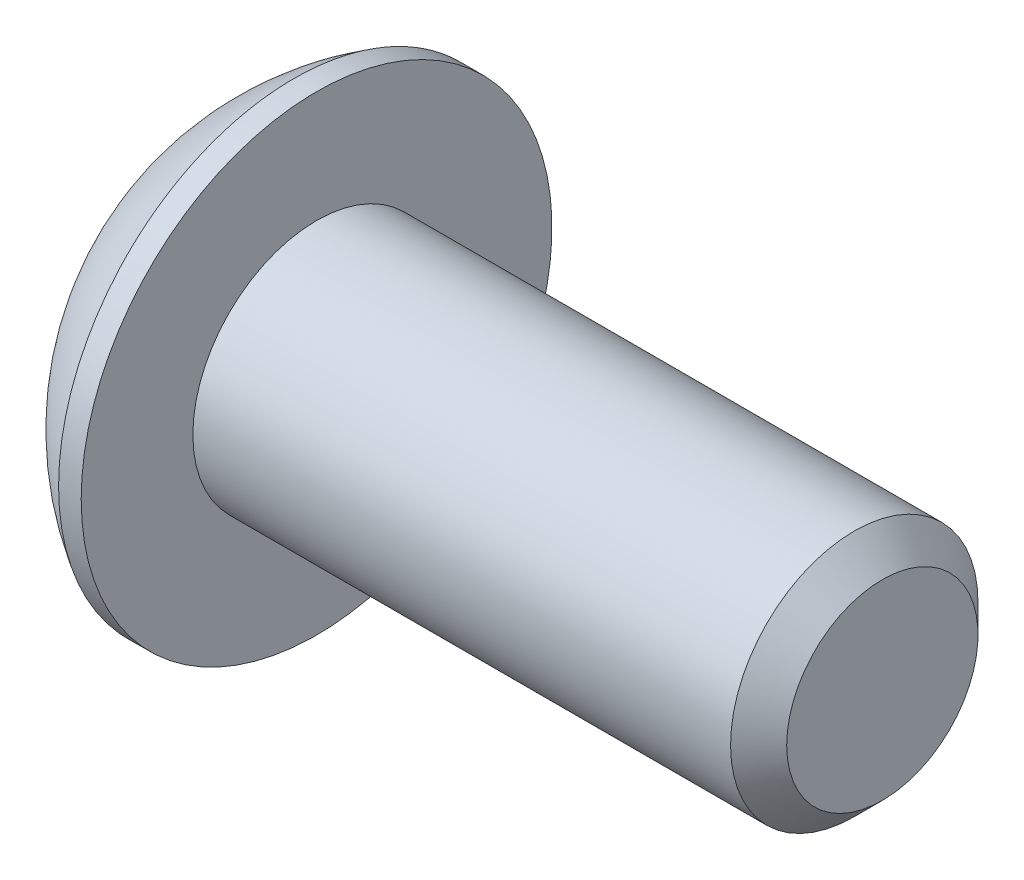
ISO-10303-21;
HEADER;
FILE_DESCRIPTION(('STEP AP214'),'2;1');
FILE_NAME('part.step','',(''),(''),'','','');
FILE_SCHEMA(('AUTOMOTIVE_DESIGN { 1 0 10303 214 1 1 1 1 }'));
ENDSEC;
DATA;
#1=APPLICATION_CONTEXT('core data for automotive mechanical design processes');
#2=APPLICATION_PROTOCOL_DEFINITION('international standard','automotive_design',2000,#1);
#3=PRODUCT_CONTEXT('',#1,'mechanical');
#4=PRODUCT('Part','Part','',(#3));
#5=PRODUCT_RELATED_PRODUCT_CATEGORY('part','',(#4));
#6=PRODUCT_DEFINITION_FORMATION('','',#4);
#7=PRODUCT_DEFINITION_CONTEXT('part definition',#1,'design');
#8=PRODUCT_DEFINITION('design','',#6,#7);
#9=PRODUCT_DEFINITION_SHAPE('','',#8);
#10=(LENGTH_UNIT() NAMED_UNIT(*) SI_UNIT(.MILLI.,.METRE.));
#11=(NAMED_UNIT(*) PLANE_ANGLE_UNIT() SI_UNIT($,.RADIAN.));
#12=(NAMED_UNIT(*) SI_UNIT($,.STERADIAN.) SOLID_ANGLE_UNIT());
#13=UNCERTAINTY_MEASURE_WITH_UNIT(LENGTH_MEASURE(1.E-05),#10,'distance_accuracy_value','');
#14=(GEOMETRIC_REPRESENTATION_CONTEXT(3) GLOBAL_UNCERTAINTY_ASSIGNED_CONTEXT((#13)) GLOBAL_UNIT_ASSIGNED_CONTEXT((#10,
#11,#12)) REPRESENTATION_CONTEXT('',''));
#15=CARTESIAN_POINT('',(0.,0.,0.));
#16=DIRECTION('',(0.,0.,1.));
#17=DIRECTION('',(1.,0.,0.));
#18=AXIS2_PLACEMENT_3D('',#15,#16,#17);
#19=CARTESIAN_POINT('',(1.32080000000034,0.,0.));
#20=DIRECTION('',(-1.,0.,0.));
#21=DIRECTION('',(0.,0.,1.));
#22=AXIS2_PLACEMENT_3D('',#19,#20,#21);
#23=CONICAL_SURFACE('',#22,1.1937999999998,1.04719755119608);
#24=CARTESIAN_POINT('',(2.01004075135902,0.,4.44089209850063E-13));
#25=VERTEX_POINT('',#24);
#26=VERTEX_LOOP('',#25);
#27=FACE_BOUND('',#26,.T.);
#28=CARTESIAN_POINT('',(1.32080000000009,0.,0.));
#29=DIRECTION('',(-1.,0.,0.));
#30=DIRECTION('',(0.,0.,1.));
#31=AXIS2_PLACEMENT_3D('',#28,#29,#30);
#32=CIRCLE('',#31,1.19380000000024);
#33=CARTESIAN_POINT('',(1.32080000000004,-1.03386112703797,0.59690000000006));
#34=VERTEX_POINT('',#33);
#35=CARTESIAN_POINT('',(1.32080000000004,0.,1.19380000000012));
#36=VERTEX_POINT('',#35);
#37=EDGE_CURVE('E19',#34,#36,#32,.T.);
#38=ORIENTED_EDGE('',*,*,#37,.T.);
#39=CARTESIAN_POINT('',(1.32080000000009,0.,0.));
#40=DIRECTION('',(-1.,0.,0.));
#41=DIRECTION('',(0.,0.,1.));
#42=AXIS2_PLACEMENT_3D('',#39,#40,#41);
#43=CIRCLE('',#42,1.19380000000024);
#44=CARTESIAN_POINT('',(1.32080000000004,1.03386112703797,0.596900000000061));
#45=VERTEX_POINT('',#44);
#46=EDGE_CURVE('E148',#36,#45,#43,.T.);
#47=ORIENTED_EDGE('',*,*,#46,.T.);
#48=CARTESIAN_POINT('',(1.32080000000009,0.,0.));
#49=DIRECTION('',(-1.,0.,0.));
#50=DIRECTION('',(0.,0.,1.));
#51=AXIS2_PLACEMENT_3D('',#48,#49,#50);
#52=CIRCLE('',#51,1.19380000000024);
#53=CARTESIAN_POINT('',(1.32080000000004,1.03386112703797,-0.596900000000061));
#54=VERTEX_POINT('',#53);
#55=EDGE_CURVE('E318',#45,#54,#52,.T.);
#56=ORIENTED_EDGE('',*,*,#55,.T.);
#57=CARTESIAN_POINT('',(1.32080000000009,0.,0.));
#58=DIRECTION('',(-1.,0.,0.));
#59=DIRECTION('',(0.,0.,1.));
#60=AXIS2_PLACEMENT_3D('',#57,#58,#59);
#61=CIRCLE('',#60,1.19380000000024);
#62=CARTESIAN_POINT('',(1.32080000000004,1.49457637585666E-12,-1.19380000000012));
#63=VERTEX_POINT('',#62);
#64=EDGE_CURVE('E319',#54,#63,#61,.T.);
#65=ORIENTED_EDGE('',*,*,#64,.T.);
#66=CARTESIAN_POINT('',(1.32080000000009,0.,0.));
#67=DIRECTION('',(-1.,0.,0.));
#68=DIRECTION('',(0.,0.,1.));
#69=AXIS2_PLACEMENT_3D('',#66,#67,#68);
#70=CIRCLE('',#69,1.19380000000024);
#71=CARTESIAN_POINT('',(1.32080000000004,-1.03386112703797,-0.59690000000006));
#72=VERTEX_POINT('',#71);
#73=EDGE_CURVE('E92',#63,#72,#70,.T.);
#74=ORIENTED_EDGE('',*,*,#73,.T.);
#75=CARTESIAN_POINT('',(1.32080000000009,0.,0.));
#76=DIRECTION('',(-1.,0.,0.));
#77=DIRECTION('',(0.,0.,1.));
#78=AXIS2_PLACEMENT_3D('',#75,#76,#77);
#79=CIRCLE('',#78,1.19380000000024);
#80=EDGE_CURVE('E88',#72,#34,#79,.T.);
#81=ORIENTED_EDGE('',*,*,#80,.T.);
#82=EDGE_LOOP('',(#38,#47,#56,#65,#74,#81));
#83=FACE_BOUND('',#82,.T.);
#84=ADVANCED_FACE('F16',(#27,#83),#23,.F.);
#85=CARTESIAN_POINT('',(1.3208,-2.06772225407572,-1.1938));
#86=DIRECTION('',(1.,0.,0.));
#87=DIRECTION('',(0.,0.,-1.));
#88=AXIS2_PLACEMENT_3D('',#85,#86,#87);
#89=PLANE('',#88);
#90=DIRECTION('',(0.,0.5,0.866025403784439));
#91=VECTOR('',#90,1.);
#92=CARTESIAN_POINT('',(1.3208,-1.37848150271715,0.));
#93=LINE('',#92,#91);
#94=CARTESIAN_POINT('',(1.3208,-0.689240751358574,1.1938));
#95=VERTEX_POINT('',#94);
#96=EDGE_CURVE('E100',#95,#34,#93,.F.);
#97=ORIENTED_EDGE('',*,*,#96,.F.);
#98=DIRECTION('',(0.,1.,0.));
#99=VECTOR('',#98,1.);
#100=CARTESIAN_POINT('',(1.3208,-0.689240751358574,1.1938));
#101=LINE('',#100,#99);
#102=EDGE_CURVE('E102',#36,#95,#101,.F.);
#103=ORIENTED_EDGE('',*,*,#102,.F.);
#104=ORIENTED_EDGE('',*,*,#37,.F.);
#105=EDGE_LOOP('',(#97,#103,#104));
#106=FACE_BOUND('',#105,.T.);
#107=ADVANCED_FACE('F98',(#106),#89,.F.);
#108=CARTESIAN_POINT('',(1.3208,-2.06772225407572,-1.1938));
#109=DIRECTION('',(1.,0.,0.));
#110=DIRECTION('',(0.,0.,-1.));
#111=AXIS2_PLACEMENT_3D('',#108,#109,#110);
#112=PLANE('',#111);
#113=DIRECTION('',(0.,-0.5,0.866025403784439));
#114=VECTOR('',#113,1.);
#115=CARTESIAN_POINT('',(1.3208,-0.689240751358574,-1.1938));
#116=LINE('',#115,#114);
#117=CARTESIAN_POINT('',(1.3208,-1.37848150271715,0.));
#118=VERTEX_POINT('',#117);
#119=EDGE_CURVE('E108',#118,#72,#116,.F.);
#120=ORIENTED_EDGE('',*,*,#119,.F.);
#121=DIRECTION('',(0.,0.5,0.866025403784439));
#122=VECTOR('',#121,1.);
#123=CARTESIAN_POINT('',(1.3208,-1.37848150271715,0.));
#124=LINE('',#123,#122);
#125=EDGE_CURVE('E105',#34,#118,#124,.F.);
#126=ORIENTED_EDGE('',*,*,#125,.F.);
#127=ORIENTED_EDGE('',*,*,#80,.F.);
#128=EDGE_LOOP('',(#120,#126,#127));
#129=FACE_BOUND('',#128,.T.);
#130=ADVANCED_FACE('F106',(#129),#112,.F.);
#131=CARTESIAN_POINT('',(1.3208,-2.06772225407572,-1.1938));
#132=DIRECTION('',(1.,0.,0.));
#133=DIRECTION('',(0.,0.,-1.));
#134=AXIS2_PLACEMENT_3D('',#131,#132,#133);
#135=PLANE('',#134);
#136=DIRECTION('',(0.,1.,0.));
#137=VECTOR('',#136,1.);
#138=CARTESIAN_POINT('',(1.3208,0.689240751358577,-1.1938));
#139=LINE('',#138,#137);
#140=CARTESIAN_POINT('',(1.3208,-0.689240751358574,-1.1938));
#141=VERTEX_POINT('',#140);
#142=EDGE_CURVE('E288',#141,#63,#139,.T.);
#143=ORIENTED_EDGE('',*,*,#142,.F.);
#144=DIRECTION('',(0.,-0.5,0.866025403784439));
#145=VECTOR('',#144,1.);
#146=CARTESIAN_POINT('',(1.3208,-0.689240751358574,-1.1938));
#147=LINE('',#146,#145);
#148=EDGE_CURVE('E300',#72,#141,#147,.F.);
#149=ORIENTED_EDGE('',*,*,#148,.F.);
#150=ORIENTED_EDGE('',*,*,#73,.F.);
#151=EDGE_LOOP('',(#143,#149,#150));
#152=FACE_BOUND('',#151,.T.);
#153=ADVANCED_FACE('F191',(#152),#135,.F.);
#154=CARTESIAN_POINT('',(1.3208,-2.06772225407572,-1.1938));
#155=DIRECTION('',(1.,0.,0.));
#156=DIRECTION('',(0.,0.,-1.));
#157=AXIS2_PLACEMENT_3D('',#154,#155,#156);
#158=PLANE('',#157);
#159=DIRECTION('',(0.,-0.5,-0.866025403784439));
#160=VECTOR('',#159,1.);
#161=CARTESIAN_POINT('',(1.3208,1.37848150271715,0.));
#162=LINE('',#161,#160);
#163=CARTESIAN_POINT('',(1.3208,0.689240751358577,-1.1938));
#164=VERTEX_POINT('',#163);
#165=EDGE_CURVE('E274',#164,#54,#162,.F.);
#166=ORIENTED_EDGE('',*,*,#165,.F.);
#167=DIRECTION('',(0.,1.,0.));
#168=VECTOR('',#167,1.);
#169=CARTESIAN_POINT('',(1.3208,0.689240751358577,-1.1938));
#170=LINE('',#169,#168);
#171=EDGE_CURVE('E285',#63,#164,#170,.T.);
#172=ORIENTED_EDGE('',*,*,#171,.F.);
#173=ORIENTED_EDGE('',*,*,#64,.F.);
#174=EDGE_LOOP('',(#166,#172,#173));
#175=FACE_BOUND('',#174,.T.);
#176=ADVANCED_FACE('F187',(#175),#158,.F.);
#177=CARTESIAN_POINT('',(1.3208,-2.06772225407572,-1.1938));
#178=DIRECTION('',(1.,0.,0.));
#179=DIRECTION('',(0.,0.,-1.));
#180=AXIS2_PLACEMENT_3D('',#177,#178,#179);
#181=PLANE('',#180);
#182=DIRECTION('',(0.,0.5,-0.866025403784439));
#183=VECTOR('',#182,1.);
#184=CARTESIAN_POINT('',(1.3208,0.689240751358576,1.1938));
#185=LINE('',#184,#183);
#186=CARTESIAN_POINT('',(1.3208,1.37848150271715,0.));
#187=VERTEX_POINT('',#186);
#188=EDGE_CURVE('E253',#187,#45,#185,.F.);
#189=ORIENTED_EDGE('',*,*,#188,.F.);
#190=DIRECTION('',(0.,-0.5,-0.866025403784439));
#191=VECTOR('',#190,1.);
#192=CARTESIAN_POINT('',(1.3208,1.37848150271715,0.));
#193=LINE('',#192,#191);
#194=EDGE_CURVE('E272',#54,#187,#193,.F.);
#195=ORIENTED_EDGE('',*,*,#194,.F.);
#196=ORIENTED_EDGE('',*,*,#55,.F.);
#197=EDGE_LOOP('',(#189,#195,#196));
#198=FACE_BOUND('',#197,.T.);
#199=ADVANCED_FACE('F183',(#198),#181,.F.);
#200=CARTESIAN_POINT('',(1.3208,-2.06772225407572,-1.1938));
#201=DIRECTION('',(1.,0.,0.));
#202=DIRECTION('',(0.,0.,-1.));
#203=AXIS2_PLACEMENT_3D('',#200,#201,#202);
#204=PLANE('',#203);
#205=DIRECTION('',(0.,1.,0.));
#206=VECTOR('',#205,1.);
#207=CARTESIAN_POINT('',(1.3208,-0.689240751358574,1.1938));
#208=LINE('',#207,#206);
#209=CARTESIAN_POINT('',(1.3208,0.689240751358576,1.1938));
#210=VERTEX_POINT('',#209);
#211=EDGE_CURVE('E117',#210,#36,#208,.F.);
#212=ORIENTED_EDGE('',*,*,#211,.F.);
#213=DIRECTION('',(0.,0.5,-0.866025403784439));
#214=VECTOR('',#213,1.);
#215=CARTESIAN_POINT('',(1.3208,0.689240751358576,1.1938));
#216=LINE('',#215,#214);
#217=EDGE_CURVE('E256',#45,#210,#216,.F.);
#218=ORIENTED_EDGE('',*,*,#217,.F.);
#219=ORIENTED_EDGE('',*,*,#46,.F.);
#220=EDGE_LOOP('',(#212,#218,#219));
#221=FACE_BOUND('',#220,.T.);
#222=ADVANCED_FACE('F179',(#221),#204,.F.);
#223=CARTESIAN_POINT('',(1.3208,-0.689240751358574,1.1938));
#224=DIRECTION('',(0.,0.,-1.));
#225=DIRECTION('',(0.,1.,0.));
#226=AXIS2_PLACEMENT_3D('',#223,#224,#225);
#227=PLANE('',#226);
#228=DIRECTION('',(0.,1.,0.));
#229=VECTOR('',#228,1.);
#230=CARTESIAN_POINT('',(0.,0.,1.1938));
#231=LINE('',#230,#229);
#232=CARTESIAN_POINT('',(0.,0.689240751358577,1.1938));
#233=VERTEX_POINT('',#232);
#234=CARTESIAN_POINT('',(0.,-0.689240751358574,1.1938));
#235=VERTEX_POINT('',#234);
#236=EDGE_CURVE('E250',#233,#235,#231,.F.);
#237=ORIENTED_EDGE('',*,*,#236,.F.);
#238=DIRECTION('',(1.,0.,0.));
#239=VECTOR('',#238,1.);
#240=CARTESIAN_POINT('',(1.3208,0.689240751358576,1.1938));
#241=LINE('',#240,#239);
#242=EDGE_CURVE('E262',#210,#233,#241,.F.);
#243=ORIENTED_EDGE('',*,*,#242,.F.);
#244=ORIENTED_EDGE('',*,*,#211,.T.);
#245=ORIENTED_EDGE('',*,*,#102,.T.);
#246=DIRECTION('',(1.,0.,0.));
#247=VECTOR('',#246,1.);
#248=CARTESIAN_POINT('',(1.3208,-0.689240751358574,1.1938));
#249=LINE('',#248,#247);
#250=EDGE_CURVE('E111',#235,#95,#249,.T.);
#251=ORIENTED_EDGE('',*,*,#250,.F.);
#252=EDGE_LOOP('',(#237,#243,#244,#245,#251));
#253=FACE_BOUND('',#252,.T.);
#254=ADVANCED_FACE('F176',(#253),#227,.T.);
#255=CARTESIAN_POINT('',(1.3208,-1.37848150271715,0.));
#256=DIRECTION('',(0.,0.866025403784439,-0.5));
#257=DIRECTION('',(0.,0.5,0.866025403784439));
#258=AXIS2_PLACEMENT_3D('',#255,#256,#257);
#259=PLANE('',#258);
#260=DIRECTION('',(0.,-0.5,-0.866025403784439));
#261=VECTOR('',#260,1.);
#262=CARTESIAN_POINT('',(0.,-0.689240751358574,1.1938));
#263=LINE('',#262,#261);
#264=CARTESIAN_POINT('',(0.,-1.37848150271715,0.));
#265=VERTEX_POINT('',#264);
#266=EDGE_CURVE('E247',#235,#265,#263,.T.);
#267=ORIENTED_EDGE('',*,*,#266,.F.);
#268=ORIENTED_EDGE('',*,*,#250,.T.);
#269=ORIENTED_EDGE('',*,*,#96,.T.);
#270=ORIENTED_EDGE('',*,*,#125,.T.);
#271=DIRECTION('',(1.,0.,0.));
#272=VECTOR('',#271,1.);
#273=CARTESIAN_POINT('',(1.3208,-1.37848150271715,0.));
#274=LINE('',#273,#272);
#275=EDGE_CURVE('E297',#265,#118,#274,.T.);
#276=ORIENTED_EDGE('',*,*,#275,.F.);
#277=EDGE_LOOP('',(#267,#268,#269,#270,#276));
#278=FACE_BOUND('',#277,.T.);
#279=ADVANCED_FACE('F115',(#278),#259,.T.);
#280=CARTESIAN_POINT('',(1.3208,-0.689240751358574,-1.1938));
#281=DIRECTION('',(0.,0.866025403784439,0.5));
#282=DIRECTION('',(0.,-0.5,0.866025403784439));
#283=AXIS2_PLACEMENT_3D('',#280,#281,#282);
#284=PLANE('',#283);
#285=DIRECTION('',(0.,0.5,-0.866025403784439));
#286=VECTOR('',#285,1.);
#287=CARTESIAN_POINT('',(0.,-1.37848150271715,0.));
#288=LINE('',#287,#286);
#289=CARTESIAN_POINT('',(0.,-0.689240751358574,-1.1938));
#290=VERTEX_POINT('',#289);
#291=EDGE_CURVE('E244',#265,#290,#288,.T.);
#292=ORIENTED_EDGE('',*,*,#291,.F.);
#293=ORIENTED_EDGE('',*,*,#275,.T.);
#294=ORIENTED_EDGE('',*,*,#119,.T.);
#295=ORIENTED_EDGE('',*,*,#148,.T.);
#296=DIRECTION('',(1.,0.,0.));
#297=VECTOR('',#296,1.);
#298=CARTESIAN_POINT('',(1.3208,-0.689240751358574,-1.1938));
#299=LINE('',#298,#297);
#300=EDGE_CURVE('E282',#290,#141,#299,.T.);
#301=ORIENTED_EDGE('',*,*,#300,.F.);
#302=EDGE_LOOP('',(#292,#293,#294,#295,#301));
#303=FACE_BOUND('',#302,.T.);
#304=ADVANCED_FACE('F169',(#303),#284,.T.);
#305=CARTESIAN_POINT('',(1.3208,0.689240751358577,-1.1938));
#306=DIRECTION('',(0.,0.,1.));
#307=DIRECTION('',(1.,0.,0.));
#308=AXIS2_PLACEMENT_3D('',#305,#306,#307);
#309=PLANE('',#308);
#310=DIRECTION('',(0.,1.,0.));
#311=VECTOR('',#310,1.);
#312=CARTESIAN_POINT('',(0.,0.,-1.1938));
#313=LINE('',#312,#311);
#314=CARTESIAN_POINT('',(0.,0.689240751358577,-1.1938));
#315=VERTEX_POINT('',#314);
#316=EDGE_CURVE('E241',#290,#315,#313,.T.);
#317=ORIENTED_EDGE('',*,*,#316,.F.);
#318=ORIENTED_EDGE('',*,*,#300,.T.);
#319=ORIENTED_EDGE('',*,*,#142,.T.);
#320=ORIENTED_EDGE('',*,*,#171,.T.);
#321=DIRECTION('',(1.,0.,0.));
#322=VECTOR('',#321,1.);
#323=CARTESIAN_POINT('',(1.3208,0.689240751358577,-1.1938));
#324=LINE('',#323,#322);
#325=EDGE_CURVE('E257',#315,#164,#324,.T.);
#326=ORIENTED_EDGE('',*,*,#325,.F.);
#327=EDGE_LOOP('',(#317,#318,#319,#320,#326));
#328=FACE_BOUND('',#327,.T.);
#329=ADVANCED_FACE('F166',(#328),#309,.T.);
#330=CARTESIAN_POINT('',(1.3208,1.37848150271715,0.));
#331=DIRECTION('',(0.,-0.866025403784439,0.5));
#332=DIRECTION('',(0.,-0.5,-0.866025403784439));
#333=AXIS2_PLACEMENT_3D('',#330,#331,#332);
#334=PLANE('',#333);
#335=DIRECTION('',(0.,0.5,0.866025403784439));
#336=VECTOR('',#335,1.);
#337=CARTESIAN_POINT('',(0.,0.689240751358577,-1.1938));
#338=LINE('',#337,#336);
#339=CARTESIAN_POINT('',(0.,1.37848150271715,0.));
#340=VERTEX_POINT('',#339);
#341=EDGE_CURVE('E238',#315,#340,#338,.T.);
#342=ORIENTED_EDGE('',*,*,#341,.F.);
#343=ORIENTED_EDGE('',*,*,#325,.T.);
#344=ORIENTED_EDGE('',*,*,#165,.T.);
#345=ORIENTED_EDGE('',*,*,#194,.T.);
#346=DIRECTION('',(1.,0.,0.));
#347=VECTOR('',#346,1.);
#348=CARTESIAN_POINT('',(1.3208,1.37848150271715,0.));
#349=LINE('',#348,#347);
#350=EDGE_CURVE('E34',#340,#187,#349,.T.);
#351=ORIENTED_EDGE('',*,*,#350,.F.);
#352=EDGE_LOOP('',(#342,#343,#344,#345,#351));
#353=FACE_BOUND('',#352,.T.);
#354=ADVANCED_FACE('F162',(#353),#334,.T.);
#355=CARTESIAN_POINT('',(1.3208,0.689240751358576,1.1938));
#356=DIRECTION('',(0.,-0.866025403784439,-0.5));
#357=DIRECTION('',(0.,0.5,-0.866025403784439));
#358=AXIS2_PLACEMENT_3D('',#355,#356,#357);
#359=PLANE('',#358);
#360=DIRECTION('',(0.,-0.5,0.866025403784439));
#361=VECTOR('',#360,1.);
#362=CARTESIAN_POINT('',(0.,1.37848150271715,0.));
#363=LINE('',#362,#361);
#364=EDGE_CURVE('E147',#340,#233,#363,.T.);
#365=ORIENTED_EDGE('',*,*,#364,.F.);
#366=ORIENTED_EDGE('',*,*,#350,.T.);
#367=ORIENTED_EDGE('',*,*,#188,.T.);
#368=ORIENTED_EDGE('',*,*,#217,.T.);
#369=ORIENTED_EDGE('',*,*,#242,.T.);
#370=EDGE_LOOP('',(#365,#366,#367,#368,#369));
#371=FACE_BOUND('',#370,.T.);
#372=ADVANCED_FACE('F158',(#371),#359,.T.);
#373=CARTESIAN_POINT('',(0.,0.,0.));
#374=DIRECTION('',(-1.,0.,0.));
#375=DIRECTION('',(0.,0.,1.));
#376=AXIS2_PLACEMENT_3D('',#373,#374,#375);
#377=PLANE('',#376);
#378=ORIENTED_EDGE('',*,*,#341,.T.);
#379=ORIENTED_EDGE('',*,*,#364,.T.);
#380=ORIENTED_EDGE('',*,*,#236,.T.);
#381=ORIENTED_EDGE('',*,*,#266,.T.);
#382=ORIENTED_EDGE('',*,*,#291,.T.);
#383=ORIENTED_EDGE('',*,*,#316,.T.);
#384=EDGE_LOOP('',(#378,#379,#380,#381,#382,#383));
#385=FACE_BOUND('',#384,.T.);
#386=CARTESIAN_POINT('',(0.,1.9812,0.));
#387=CARTESIAN_POINT('',(0.,1.9811996664299,0.0556258831179428));
#388=CARTESIAN_POINT('',(0.,1.97885520380442,0.111261989398606));
#389=CARTESIAN_POINT('',(0.,1.96949260169541,0.222149719830458));
#390=CARTESIAN_POINT('',(0.,1.96247308239605,0.277401225602895));
#391=CARTESIAN_POINT('',(0.,1.94379192841038,0.387209508139747));
#392=CARTESIAN_POINT('',(-1.85325793235264E-13,1.93212292489526,0.441765039546365));
#393=CARTESIAN_POINT('',(1.86344214223505E-13,1.90422331175315,0.549729449347493));
#394=CARTESIAN_POINT('',(6.94543371897454E-13,1.88798900035338,0.603137359208869));
#395=CARTESIAN_POINT('',(1.15501975216981E-12,1.83266214476501,0.760839131321828));
#396=CARTESIAN_POINT('',(0.,1.78690023648845,0.862876433575429));
#397=CARTESIAN_POINT('',(0.,1.67887358150667,1.05780719540872));
#398=CARTESIAN_POINT('',(9.54193214892627E-13,1.6166082074585,1.15070030720801));
#399=CARTESIAN_POINT('',(5.94805591894675E-13,1.51224157140982,1.28116890915697));
#400=CARTESIAN_POINT('',(1.63221293851378E-13,1.4755970394354,1.32320451127026));
#401=CARTESIAN_POINT('',(-1.62196980336157E-13,1.39893832619713,1.40400288695709));
#402=CARTESIAN_POINT('',(0.,1.35892742784698,1.44276877695455));
#403=CARTESIAN_POINT('',(1.14362537325405E-13,1.23416504602197,1.55382272417904));
#404=CARTESIAN_POINT('',(0.,1.14466125559859,1.62089527952111));
#405=CARTESIAN_POINT('',(0.,0.955712144178167,1.7390221808118));
#406=CARTESIAN_POINT('',(0.,0.856267198233564,1.79007713076007));
#407=CARTESIAN_POINT('',(0.,0.650206345910843,1.87477637530954));
#408=CARTESIAN_POINT('',(0.,0.543590516134855,1.90842085586267));
#409=CARTESIAN_POINT('',(0.,0.326226155292018,1.95733039300656));
#410=CARTESIAN_POINT('',(0.,0.21547760215793,1.97259535144288));
#411=CARTESIAN_POINT('',(0.,-0.00701040587544639,1.98431697865418));
#412=CARTESIAN_POINT('',(0.,-0.118749860774734,1.98077364742917));
#413=CARTESIAN_POINT('',(0.,-0.340050178355485,1.95497485623825));
#414=CARTESIAN_POINT('',(0.,-0.449611052668255,1.93271949620218));
#415=CARTESIAN_POINT('',(0.,-0.663431110729174,1.87014138774523));
#416=CARTESIAN_POINT('',(0.,-0.76769023783852,1.82981844635272));
#417=CARTESIAN_POINT('',(0.,-0.968005760719347,1.73219968377096));
#418=CARTESIAN_POINT('',(0.,-1.0640618469811,1.6749032225164));
#419=CARTESIAN_POINT('',(0.,-1.19980276751283,1.57757371205873));
#420=CARTESIAN_POINT('',(0.,-1.24366557129213,1.54322665019466));
#421=CARTESIAN_POINT('',(0.,-1.32838995706696,1.47093063174264));
#422=CARTESIAN_POINT('',(0.,-1.36924860178706,1.43297823102439));
#423=CARTESIAN_POINT('',(0.,-1.48674671849223,1.31419842051173));
#424=CARTESIAN_POINT('',(0.,-1.55842832343237,1.22836221289311));
#425=CARTESIAN_POINT('',(0.,-1.6863396856475,1.04586168272493));
#426=CARTESIAN_POINT('',(0.,-1.7425700302488,0.949197771949774));
#427=CARTESIAN_POINT('',(0.,-1.8141614250401,0.798182600298684));
#428=CARTESIAN_POINT('',(0.,-1.83591780585875,0.746776203847791));
#429=CARTESIAN_POINT('',(0.,-1.87500754181092,0.642341081688636));
#430=CARTESIAN_POINT('',(0.,-1.89234447645404,0.589313708122847));
#431=CARTESIAN_POINT('',(0.,-1.92246053433554,0.482076273028395));
#432=CARTESIAN_POINT('',(0.,-1.93524685475118,0.42786822425751));
#433=CARTESIAN_POINT('',(0.,-1.95620937250494,0.318578151844611));
#434=CARTESIAN_POINT('',(0.,-1.96438692958147,0.263496390912872));
#435=CARTESIAN_POINT('',(0.,-1.97388528284653,0.173607715038558));
#436=CARTESIAN_POINT('',(0.,-1.97662743364426,0.138944718024998));
#437=CARTESIAN_POINT('',(0.,-1.98028489645283,0.0695224782567002));
#438=CARTESIAN_POINT('',(0.,-1.98120020846367,0.0347632355019631));
#439=CARTESIAN_POINT('',(0.,-1.9811996664299,-0.0556258831179437));
#440=CARTESIAN_POINT('',(0.,-1.97885520380442,-0.111261989398607));
#441=CARTESIAN_POINT('',(0.,-1.96949260169541,-0.222149719830459));
#442=CARTESIAN_POINT('',(0.,-1.96247308239605,-0.277401225602897));
#443=CARTESIAN_POINT('',(0.,-1.94379192841039,-0.387209508139749));
#444=CARTESIAN_POINT('',(-1.85269749640691E-13,-1.93212292489526,-0.441765039546367));
#445=CARTESIAN_POINT('',(1.86288125054388E-13,-1.90422331175315,-0.549729449347495));
#446=CARTESIAN_POINT('',(6.94525090263764E-13,-1.88798900035338,-0.603137359208872));
#447=CARTESIAN_POINT('',(1.15505622829081E-12,-1.83266214476501,-0.760839131321831));
#448=CARTESIAN_POINT('',(0.,-1.78690023648845,-0.862876433575431));
#449=CARTESIAN_POINT('',(0.,-1.67887358150667,-1.05780719540872));
#450=CARTESIAN_POINT('',(9.54248812869379E-13,-1.6166082074585,-1.15070030720801));
#451=CARTESIAN_POINT('',(5.94777756479239E-13,-1.51224157140982,-1.28116890915698));
#452=CARTESIAN_POINT('',(1.63138949183833E-13,-1.47559703943539,-1.32320451127027));
#453=CARTESIAN_POINT('',(-1.62114715061273E-13,-1.39893832619713,-1.40400288695709));
#454=CARTESIAN_POINT('',(0.,-1.35892742784699,-1.44276877695455));
#455=CARTESIAN_POINT('',(1.13760489124207E-13,-1.23416504602197,-1.55382272417904));
#456=CARTESIAN_POINT('',(0.,-1.14466125559859,-1.62089527952111));
#457=CARTESIAN_POINT('',(0.,-0.95571214417816,-1.73902218081179));
#458=CARTESIAN_POINT('',(0.,-0.856267198233559,-1.79007713076007));
#459=CARTESIAN_POINT('',(0.,-0.650206345910841,-1.87477637530954));
#460=CARTESIAN_POINT('',(0.,-0.543590516134854,-1.90842085586267));
#461=CARTESIAN_POINT('',(0.,-0.326226155292018,-1.95733039300657));
#462=CARTESIAN_POINT('',(0.,-0.215477602157929,-1.97259535144288));
#463=CARTESIAN_POINT('',(0.,0.0070104058754487,-1.98431697865418));
#464=CARTESIAN_POINT('',(0.,0.118749860774737,-1.98077364742916));
#465=CARTESIAN_POINT('',(0.,0.340050178355489,-1.95497485623824));
#466=CARTESIAN_POINT('',(0.,0.44961105266826,-1.93271949620218));
#467=CARTESIAN_POINT('',(0.,0.663431110729178,-1.87014138774524));
#468=CARTESIAN_POINT('',(0.,0.767690237838524,-1.82981844635272));
#469=CARTESIAN_POINT('',(0.,0.968005760719348,-1.73219968377096));
#470=CARTESIAN_POINT('',(0.,1.0640618469811,-1.67490322251639));
#471=CARTESIAN_POINT('',(0.,1.19980276751283,-1.57757371205873));
#472=CARTESIAN_POINT('',(0.,1.24366557129214,-1.54322665019465));
#473=CARTESIAN_POINT('',(0.,1.32838995706696,-1.47093063174263));
#474=CARTESIAN_POINT('',(0.,1.36924860178706,-1.43297823102439));
#475=CARTESIAN_POINT('',(0.,1.48674671849223,-1.31419842051172));
#476=CARTESIAN_POINT('',(0.,1.55842832343237,-1.22836221289311));
#477=CARTESIAN_POINT('',(0.,1.6863396856475,-1.04586168272492));
#478=CARTESIAN_POINT('',(0.,1.7425700302488,-0.949197771949768));
#479=CARTESIAN_POINT('',(0.,1.8141614250401,-0.798182600298677));
#480=CARTESIAN_POINT('',(0.,1.83591780585875,-0.746776203847785));
#481=CARTESIAN_POINT('',(0.,1.87500754181092,-0.64234108168863));
#482=CARTESIAN_POINT('',(0.,1.89234447645404,-0.589313708122841));
#483=CARTESIAN_POINT('',(0.,1.92246053433555,-0.482076273028389));
#484=CARTESIAN_POINT('',(0.,1.93524685475118,-0.427868224257505));
#485=CARTESIAN_POINT('',(0.,1.95620937250494,-0.318578151844605));
#486=CARTESIAN_POINT('',(0.,1.96438692958147,-0.263496390912866));
#487=CARTESIAN_POINT('',(0.,1.97388528284653,-0.173607715038553));
#488=CARTESIAN_POINT('',(0.,1.97662743364426,-0.138944718024994));
#489=CARTESIAN_POINT('',(0.,1.98028489645283,-0.0695224782566989));
#490=CARTESIAN_POINT('',(0.,1.98120020846367,-0.034763235501963));
#491=CARTESIAN_POINT('',(0.,1.9812,0.));
#492=B_SPLINE_CURVE_WITH_KNOTS('',3,(#386,#387,#388,#389,#390,#391,#392,#393,#394,#395,#396,
#397,#398,#399,#400,#401,#402,#403,#404,#405,#406,#407,#408,#409,#410,#411,#412,#413,#414,#415,
#416,#417,#418,#419,#420,#421,#422,#423,#424,#425,#426,#427,#428,#429,#430,#431,#432,#433,#434,
#435,#436,#437,#438,#439,#440,#441,#442,#443,#444,#445,#446,#447,#448,#449,#450,#451,#452,#453,
#454,#455,#456,#457,#458,#459,#460,#461,#462,#463,#464,#465,#466,#467,#468,#469,#470,#471,#472,
#473,#474,#475,#476,#477,#478,#479,#480,#481,#482,#483,#484,#485,#486,#487,#488,#489,#490,#491),
.UNSPECIFIED.,.T.,.F.,(4,2,2,2,2,2,2,2,2,2,2,2,2,2,2,2,2,2,2,2,2,2,2,2,2,2,2,2,2,2,2,2,2,2,2,2,
2,2,2,2,2,2,2,2,2,2,2,2,2,2,2,2,4),(0.,0.166845646007828,0.333740557374255,0.500901034367693,
0.668197445942386,1.00199278686282,1.33580081809885,1.50292354032982,1.6698851310853,
2.00370118900129,2.33750465770544,2.67130456115909,3.005106247238,3.33890793331696,
3.67270783677065,4.00651130547476,4.34032736339026,4.50728895414554,4.67441167637632,
5.00821970761259,5.34201504853332,5.50931146010827,5.67647193710191,5.84336684846844,
6.0102124944764,6.11448220058334,6.21875190669029,6.38559755269812,6.55249246406454,
6.71965294105798,6.88694935263268,7.22074469355311,7.55455272478915,7.72167544702011,
7.88863703777559,8.22245309569158,8.55625656439573,8.89005646784938,9.2238581539283,
9.55765984000725,9.89145974346094,10.2252632121651,10.5590792700806,10.7260408608358,
10.8931635830666,11.2269716143029,11.5607669552236,11.7280633667986,11.8952238437922,
12.0621187551587,12.2289644011667,12.3332341072736,12.4375038133806),.UNSPECIFIED.);
#493=CARTESIAN_POINT('',(0.,1.9812,0.));
#494=VERTEX_POINT('',#493);
#495=EDGE_CURVE('E139',#494,#494,#492,.T.);
#496=ORIENTED_EDGE('',*,*,#495,.F.);
#497=EDGE_LOOP('',(#496));
#498=FACE_BOUND('',#497,.T.);
#499=ADVANCED_FACE('F154',(#385,#498),#377,.T.);
#500=CARTESIAN_POINT('',(4.13385,0.,0.));
#501=DIRECTION('',(0.,1.,0.));
#502=DIRECTION('',(1.,0.,0.));
#503=AXIS2_PLACEMENT_3D('',#500,#501,#502);
#504=SPHERICAL_SURFACE('',#503,4.58408870578439);
#505=CARTESIAN_POINT('',(1.8288,0.,0.));
#506=DIRECTION('',(-1.,0.,0.));
#507=DIRECTION('',(0.,0.,1.));
#508=AXIS2_PLACEMENT_3D('',#505,#506,#507);
#509=CIRCLE('',#508,3.9624);
#510=CARTESIAN_POINT('',(1.8288,0.,3.9624));
#511=VERTEX_POINT('',#510);
#512=EDGE_CURVE('E136',#511,#511,#509,.F.);
#513=ORIENTED_EDGE('',*,*,#512,.F.);
#514=EDGE_LOOP('',(#513));
#515=FACE_BOUND('',#514,.T.);
#516=ORIENTED_EDGE('',*,*,#495,.T.);
#517=EDGE_LOOP('',(#516));
#518=FACE_BOUND('',#517,.T.);
#519=ADVANCED_FACE('F150',(#515,#518),#504,.T.);
#520=CARTESIAN_POINT('',(11.7348,0.,0.));
#521=DIRECTION('',(-1.,0.,0.));
#522=DIRECTION('',(0.,0.,1.));
#523=AXIS2_PLACEMENT_3D('',#520,#521,#522);
#524=PLANE('',#523);
#525=CARTESIAN_POINT('',(11.7347999999424,0.,0.));
#526=DIRECTION('',(-1.,0.,0.));
#527=DIRECTION('',(0.,0.,1.));
#528=AXIS2_PLACEMENT_3D('',#525,#526,#527);
#529=CIRCLE('',#528,1.61036000002923);
#530=CARTESIAN_POINT('',(11.7347999999424,0.,1.61036000002923));
#531=VERTEX_POINT('',#530);
#532=EDGE_CURVE('E133',#531,#531,#529,.T.);
#533=ORIENTED_EDGE('',*,*,#532,.F.);
#534=EDGE_LOOP('',(#533));
#535=FACE_BOUND('',#534,.T.);
#536=ADVANCED_FACE('F222',(#535),#524,.F.);
#537=CARTESIAN_POINT('',(0.,0.,0.));
#538=DIRECTION('',(-1.,0.,0.));
#539=DIRECTION('',(0.,0.,1.));
#540=AXIS2_PLACEMENT_3D('',#537,#538,#539);
#541=CYLINDRICAL_SURFACE('',#540,3.9624);
#542=ORIENTED_EDGE('',*,*,#512,.T.);
#543=EDGE_LOOP('',(#542));
#544=FACE_BOUND('',#543,.T.);
#545=CARTESIAN_POINT('',(2.2098,0.,0.));
#546=DIRECTION('',(-1.,0.,0.));
#547=DIRECTION('',(0.,0.,1.));
#548=AXIS2_PLACEMENT_3D('',#545,#546,#547);
#549=CIRCLE('',#548,3.9624);
#550=CARTESIAN_POINT('',(2.2098,0.,3.9624));
#551=VERTEX_POINT('',#550);
#552=EDGE_CURVE('E130',#551,#551,#549,.T.);
#553=ORIENTED_EDGE('',*,*,#552,.T.);
#554=EDGE_LOOP('',(#553));
#555=FACE_BOUND('',#554,.T.);
#556=ADVANCED_FACE('F219',(#544,#555),#541,.T.);
#557=CARTESIAN_POINT('',(11.2623600000461,0.,0.));
#558=DIRECTION('',(-1.,0.,0.));
#559=DIRECTION('',(0.,0.,1.));
#560=AXIS2_PLACEMENT_3D('',#557,#558,#559);
#561=CONICAL_SURFACE('',#560,2.08279999992556,0.785398163397448);
#562=ORIENTED_EDGE('',*,*,#532,.T.);
#563=EDGE_LOOP('',(#562));
#564=FACE_BOUND('',#563,.T.);
#565=CARTESIAN_POINT('',(11.26236,0.,0.));
#566=DIRECTION('',(-1.,0.,0.));
#567=DIRECTION('',(0.,0.,1.));
#568=AXIS2_PLACEMENT_3D('',#565,#566,#567);
#569=CIRCLE('',#568,2.0828);
#570=CARTESIAN_POINT('',(11.26236,0.,2.0828));
#571=VERTEX_POINT('',#570);
#572=EDGE_CURVE('E25',#571,#571,#569,.T.);
#573=ORIENTED_EDGE('',*,*,#572,.F.);
#574=EDGE_LOOP('',(#573));
#575=FACE_BOUND('',#574,.T.);
#576=ADVANCED_FACE('F211',(#564,#575),#561,.T.);
#577=CARTESIAN_POINT('',(2.2098,2.0828,0.));
#578=DIRECTION('',(-1.,0.,0.));
#579=DIRECTION('',(0.,0.,1.));
#580=AXIS2_PLACEMENT_3D('',#577,#578,#579);
#581=PLANE('',#580);
#582=CARTESIAN_POINT('',(2.2098,0.,0.));
#583=DIRECTION('',(-1.,0.,0.));
#584=DIRECTION('',(0.,0.,1.));
#585=AXIS2_PLACEMENT_3D('',#582,#583,#584);
#586=CIRCLE('',#585,2.0828);
#587=CARTESIAN_POINT('',(2.2098,0.,2.0828));
#588=VERTEX_POINT('',#587);
#589=EDGE_CURVE('E11',#588,#588,#586,.F.);
#590=ORIENTED_EDGE('',*,*,#589,.F.);
#591=EDGE_LOOP('',(#590));
#592=FACE_BOUND('',#591,.T.);
#593=ORIENTED_EDGE('',*,*,#552,.F.);
#594=EDGE_LOOP('',(#593));
#595=FACE_BOUND('',#594,.T.);
#596=ADVANCED_FACE('F205',(#592,#595),#581,.F.);
#597=CARTESIAN_POINT('',(0.,0.,0.));
#598=DIRECTION('',(-1.,0.,0.));
#599=DIRECTION('',(0.,0.,1.));
#600=AXIS2_PLACEMENT_3D('',#597,#598,#599);
#601=CYLINDRICAL_SURFACE('',#600,2.0828);
#602=ORIENTED_EDGE('',*,*,#572,.T.);
#603=EDGE_LOOP('',(#602));
#604=FACE_BOUND('',#603,.T.);
#605=ORIENTED_EDGE('',*,*,#589,.T.);
#606=EDGE_LOOP('',(#605));
#607=FACE_BOUND('',#606,.T.);
#608=ADVANCED_FACE('F203',(#604,#607),#601,.T.);
#609=CLOSED_SHELL('',(#84,#107,#130,#153,#176,#199,#222,#254,#279,#304,#329,#354,#372,#499,#519,
#536,#556,#576,#596,#608));
#610=MANIFOLD_SOLID_BREP('B1',#609);
#611=ADVANCED_BREP_SHAPE_REPRESENTATION('',(#18,#610),#14);
#612=SHAPE_DEFINITION_REPRESENTATION(#9,#611);
ENDSEC;
END-ISO-10303-21;
